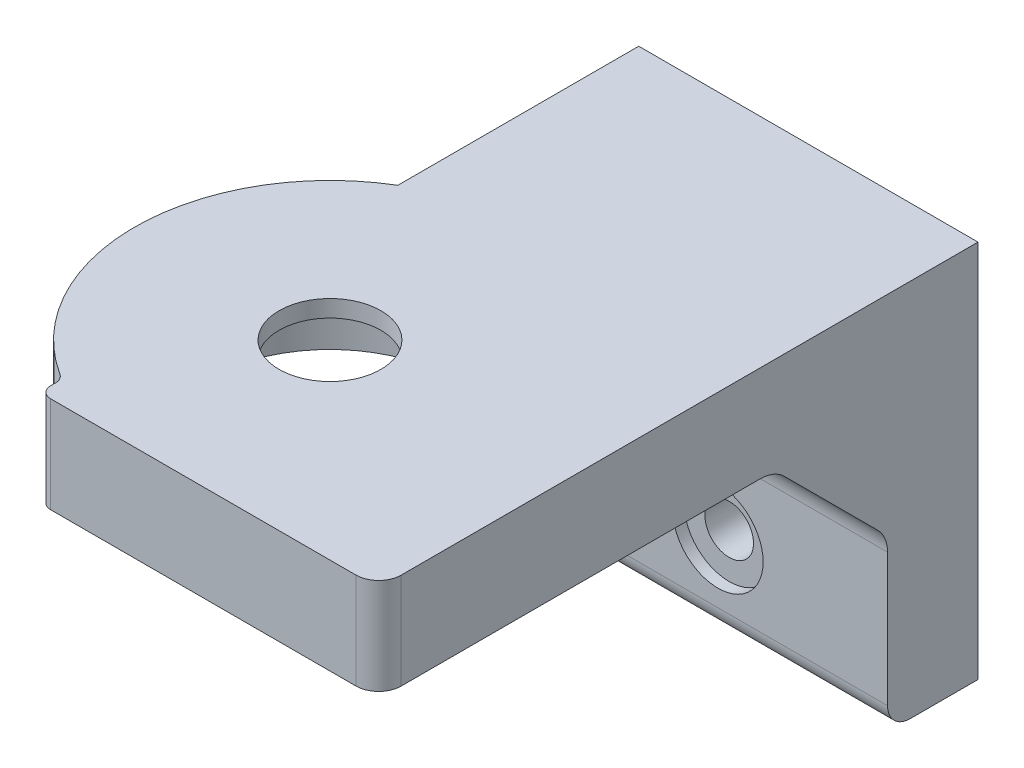
ISO-10303-21;
HEADER;
FILE_DESCRIPTION(('STEP AP214'),'2;1');
FILE_NAME('part.step','',(''),(''),'','','');
FILE_SCHEMA(('AUTOMOTIVE_DESIGN { 1 0 10303 214 1 1 1 1 }'));
ENDSEC;
DATA;
#1=APPLICATION_CONTEXT('core data for automotive mechanical design processes');
#2=APPLICATION_PROTOCOL_DEFINITION('international standard','automotive_design',2000,#1);
#3=PRODUCT_CONTEXT('',#1,'mechanical');
#4=PRODUCT('Part','Part','',(#3));
#5=PRODUCT_RELATED_PRODUCT_CATEGORY('part','',(#4));
#6=PRODUCT_DEFINITION_FORMATION('','',#4);
#7=PRODUCT_DEFINITION_CONTEXT('part definition',#1,'design');
#8=PRODUCT_DEFINITION('design','',#6,#7);
#9=PRODUCT_DEFINITION_SHAPE('','',#8);
#10=(LENGTH_UNIT() NAMED_UNIT(*) SI_UNIT(.MILLI.,.METRE.));
#11=(NAMED_UNIT(*) PLANE_ANGLE_UNIT() SI_UNIT($,.RADIAN.));
#12=(NAMED_UNIT(*) SI_UNIT($,.STERADIAN.) SOLID_ANGLE_UNIT());
#13=UNCERTAINTY_MEASURE_WITH_UNIT(LENGTH_MEASURE(1.E-05),#10,'distance_accuracy_value','');
#14=(GEOMETRIC_REPRESENTATION_CONTEXT(3) GLOBAL_UNCERTAINTY_ASSIGNED_CONTEXT((#13)) GLOBAL_UNIT_ASSIGNED_CONTEXT((#10,
#11,#12)) REPRESENTATION_CONTEXT('',''));
#15=CARTESIAN_POINT('',(0.,0.,0.));
#16=DIRECTION('',(0.,0.,1.));
#17=DIRECTION('',(1.,0.,0.));
#18=AXIS2_PLACEMENT_3D('',#15,#16,#17);
#19=CARTESIAN_POINT('',(-25.3000004357424,-651.000000000001,1.38777878078145E-13));
#20=DIRECTION('',(0.,0.,1.));
#21=DIRECTION('',(1.,0.,0.));
#22=AXIS2_PLACEMENT_3D('',#19,#20,#21);
#23=CYLINDRICAL_SURFACE('',#22,2.15);
#24=CARTESIAN_POINT('',(-25.3000004357424,-651.000000000001,1.38777878078145E-13));
#25=DIRECTION('',(0.,0.,1.));
#26=DIRECTION('',(1.,0.,0.));
#27=AXIS2_PLACEMENT_3D('',#24,#25,#26);
#28=CIRCLE('',#27,2.15);
#29=CARTESIAN_POINT('',(-23.1500004357424,-651.000000000001,1.38777878078145E-13));
#30=VERTEX_POINT('',#29);
#31=EDGE_CURVE('E187',#30,#30,#28,.T.);
#32=ORIENTED_EDGE('',*,*,#31,.F.);
#33=EDGE_LOOP('',(#32));
#34=FACE_BOUND('',#33,.T.);
#35=CARTESIAN_POINT('',(-25.3000004357446,-651.000000000001,6.99999999999998));
#36=DIRECTION('',(0.,0.,1.));
#37=DIRECTION('',(1.,0.,0.));
#38=AXIS2_PLACEMENT_3D('',#35,#36,#37);
#39=CIRCLE('',#38,2.15);
#40=CARTESIAN_POINT('',(-23.1500004357446,-651.000000000001,6.99999999999998));
#41=VERTEX_POINT('',#40);
#42=EDGE_CURVE('E478',#41,#41,#39,.T.);
#43=ORIENTED_EDGE('',*,*,#42,.T.);
#44=EDGE_LOOP('',(#43));
#45=FACE_BOUND('',#44,.T.);
#46=ADVANCED_FACE('F55',(#34,#45),#23,.F.);
#47=CARTESIAN_POINT('',(2.66977248110864E-12,-626.500000000001,0.));
#48=DIRECTION('',(0.,1.,0.));
#49=DIRECTION('',(-1.,0.,0.));
#50=AXIS2_PLACEMENT_3D('',#47,#48,#49);
#51=PLANE('',#50);
#52=CARTESIAN_POINT('',(-31.4500004358079,-626.500000000001,36.149999999999));
#53=DIRECTION('',(0.,1.,0.));
#54=DIRECTION('',(-1.,0.,0.));
#55=AXIS2_PLACEMENT_3D('',#52,#53,#54);
#56=CIRCLE('',#55,4.5);
#57=CARTESIAN_POINT('',(-35.9500004358079,-626.500000000001,36.149999999999));
#58=VERTEX_POINT('',#57);
#59=EDGE_CURVE('E182',#58,#58,#56,.T.);
#60=ORIENTED_EDGE('',*,*,#59,.T.);
#61=EDGE_LOOP('',(#60));
#62=FACE_BOUND('',#61,.T.);
#63=CARTESIAN_POINT('',(-31.4500004358096,-626.500000000001,36.1500000000001));
#64=DIRECTION('',(0.,1.,0.));
#65=DIRECTION('',(-1.,0.,0.));
#66=AXIS2_PLACEMENT_3D('',#63,#64,#65);
#67=CIRCLE('',#66,11.);
#68=CARTESIAN_POINT('',(-42.4500004358096,-626.500000000001,36.1500000000001));
#69=VERTEX_POINT('',#68);
#70=EDGE_CURVE('E232',#69,#69,#67,.T.);
#71=ORIENTED_EDGE('',*,*,#70,.F.);
#72=EDGE_LOOP('',(#71));
#73=FACE_BOUND('',#72,.T.);
#74=ADVANCED_FACE('F356',(#62,#73),#51,.F.);
#75=CARTESIAN_POINT('',(-31.4500004358091,-626.500000000001,36.149999999999));
#76=DIRECTION('',(0.,1.,0.));
#77=DIRECTION('',(-1.,0.,0.));
#78=AXIS2_PLACEMENT_3D('',#75,#76,#77);
#79=CYLINDRICAL_SURFACE('',#78,17.2871339440318);
#80=CARTESIAN_POINT('',(-31.4500004358091,-633.500000000001,36.149999999999));
#81=DIRECTION('',(0.,1.,0.));
#82=DIRECTION('',(-1.,0.,0.));
#83=AXIS2_PLACEMENT_3D('',#80,#81,#82);
#84=CIRCLE('',#83,17.2871339440318);
#85=CARTESIAN_POINT('',(-40.300000435745,-633.500000000001,21.2999999999979));
#86=VERTEX_POINT('',#85);
#87=CARTESIAN_POINT('',(-40.7613703786741,-633.500000000001,50.715142971697));
#88=VERTEX_POINT('',#87);
#89=EDGE_CURVE('E199',#86,#88,#84,.T.);
#90=ORIENTED_EDGE('',*,*,#89,.T.);
#91=DIRECTION('',(0.,1.,0.));
#92=VECTOR('',#91,1.);
#93=CARTESIAN_POINT('',(-40.7613703786741,-626.500000000001,50.715142971697));
#94=LINE('',#93,#92);
#95=CARTESIAN_POINT('',(-40.7613703786741,-625.000000000001,50.715142971697));
#96=VERTEX_POINT('',#95);
#97=EDGE_CURVE('E242',#88,#96,#94,.T.);
#98=ORIENTED_EDGE('',*,*,#97,.T.);
#99=CARTESIAN_POINT('',(-31.4500004358091,-625.000000000001,36.149999999999));
#100=DIRECTION('',(0.,1.,0.));
#101=DIRECTION('',(-1.,0.,0.));
#102=AXIS2_PLACEMENT_3D('',#99,#100,#101);
#103=CIRCLE('',#102,17.2871339440318);
#104=CARTESIAN_POINT('',(-40.3000004357449,-625.000000000001,21.2999999999979));
#105=VERTEX_POINT('',#104);
#106=EDGE_CURVE('E211',#96,#105,#103,.F.);
#107=ORIENTED_EDGE('',*,*,#106,.T.);
#108=DIRECTION('',(0.,1.,0.));
#109=VECTOR('',#108,1.);
#110=CARTESIAN_POINT('',(-40.3000004357449,-626.500000000001,21.2999999999979));
#111=LINE('',#110,#109);
#112=EDGE_CURVE('E229',#86,#105,#111,.T.);
#113=ORIENTED_EDGE('',*,*,#112,.F.);
#114=EDGE_LOOP('',(#90,#98,#107,#113));
#115=FACE_BOUND('',#114,.T.);
#116=ADVANCED_FACE('F329',(#115),#79,.T.);
#117=CARTESIAN_POINT('',(-40.300000435745,-626.500000000001,0.));
#118=DIRECTION('',(-1.,0.,0.));
#119=DIRECTION('',(0.,-1.,0.));
#120=AXIS2_PLACEMENT_3D('',#117,#118,#119);
#121=PLANE('',#120);
#122=DIRECTION('',(0.,0.,-1.));
#123=VECTOR('',#122,1.);
#124=CARTESIAN_POINT('',(-40.3000004357448,-658.500000000001,8.00000000000059));
#125=LINE('',#124,#123);
#126=CARTESIAN_POINT('',(-40.3000004357449,-658.500000000001,6.00000000000059));
#127=VERTEX_POINT('',#126);
#128=CARTESIAN_POINT('',(-40.300000435745,-658.500000000001,5.87238597438503E-13));
#129=VERTEX_POINT('',#128);
#130=EDGE_CURVE('E172',#127,#129,#125,.T.);
#131=ORIENTED_EDGE('',*,*,#130,.F.);
#132=CARTESIAN_POINT('',(-40.3000004357449,-656.500000000001,6.00000000000059));
#133=DIRECTION('',(-1.,0.,0.));
#134=DIRECTION('',(0.,-1.,0.));
#135=AXIS2_PLACEMENT_3D('',#132,#133,#134);
#136=CIRCLE('',#135,2.);
#137=CARTESIAN_POINT('',(-40.3000004357448,-656.500000000001,8.00000000000059));
#138=VERTEX_POINT('',#137);
#139=EDGE_CURVE('E77',#127,#138,#136,.T.);
#140=ORIENTED_EDGE('',*,*,#139,.T.);
#141=DIRECTION('',(0.,1.,0.));
#142=VECTOR('',#141,1.);
#143=CARTESIAN_POINT('',(-40.3000004357448,-633.500000000001,8.00000000000059));
#144=LINE('',#143,#142);
#145=CARTESIAN_POINT('',(-40.3000004357448,-644.74264068712,8.00000000000059));
#146=VERTEX_POINT('',#145);
#147=EDGE_CURVE('E186',#138,#146,#144,.T.);
#148=ORIENTED_EDGE('',*,*,#147,.T.);
#149=CARTESIAN_POINT('',(-40.3000004357449,-644.74264068712,11.0000000000006));
#150=DIRECTION('',(-1.,0.,0.));
#151=DIRECTION('',(0.,-1.,0.));
#152=AXIS2_PLACEMENT_3D('',#149,#150,#151);
#153=CIRCLE('',#152,3.);
#154=CARTESIAN_POINT('',(-40.3000004357449,-642.621320343561,8.87867965644104));
#155=VERTEX_POINT('',#154);
#156=EDGE_CURVE('E282',#146,#155,#153,.F.);
#157=ORIENTED_EDGE('',*,*,#156,.T.);
#158=DIRECTION('',(0.,0.707106781186545,0.70710678118655));
#159=VECTOR('',#158,1.);
#160=CARTESIAN_POINT('',(-40.300000435745,-633.500000000001,18.0000000000006));
#161=LINE('',#160,#159);
#162=CARTESIAN_POINT('',(-40.300000435745,-634.378679656442,17.1213203435603));
#163=VERTEX_POINT('',#162);
#164=EDGE_CURVE('E239',#155,#163,#161,.T.);
#165=ORIENTED_EDGE('',*,*,#164,.T.);
#166=CARTESIAN_POINT('',(-40.300000435745,-636.500000000001,19.2426406871199));
#167=DIRECTION('',(-1.,0.,0.));
#168=DIRECTION('',(0.,-1.,0.));
#169=AXIS2_PLACEMENT_3D('',#166,#167,#168);
#170=CIRCLE('',#169,3.);
#171=CARTESIAN_POINT('',(-40.300000435745,-633.500000000001,19.2426406871199));
#172=VERTEX_POINT('',#171);
#173=EDGE_CURVE('E288',#163,#172,#170,.F.);
#174=ORIENTED_EDGE('',*,*,#173,.T.);
#175=DIRECTION('',(0.,0.,1.));
#176=VECTOR('',#175,1.);
#177=CARTESIAN_POINT('',(-40.300000435745,-633.500000000001,0.));
#178=LINE('',#177,#176);
#179=EDGE_CURVE('E209',#172,#86,#178,.T.);
#180=ORIENTED_EDGE('',*,*,#179,.T.);
#181=ORIENTED_EDGE('',*,*,#112,.T.);
#182=DIRECTION('',(0.,0.,1.));
#183=VECTOR('',#182,1.);
#184=CARTESIAN_POINT('',(-40.300000435745,-625.000000000001,0.));
#185=LINE('',#184,#183);
#186=CARTESIAN_POINT('',(-40.300000435745,-625.000000000001,5.82867087928207E-13));
#187=VERTEX_POINT('',#186);
#188=EDGE_CURVE('E224',#187,#105,#185,.T.);
#189=ORIENTED_EDGE('',*,*,#188,.F.);
#190=DIRECTION('',(0.,1.,0.));
#191=VECTOR('',#190,1.);
#192=CARTESIAN_POINT('',(-40.300000435745,-626.500000000001,5.82867087928207E-13));
#193=LINE('',#192,#191);
#194=EDGE_CURVE('E181',#129,#187,#193,.T.);
#195=ORIENTED_EDGE('',*,*,#194,.F.);
#196=EDGE_LOOP('',(#131,#140,#148,#157,#165,#174,#180,#181,#189,#195));
#197=FACE_BOUND('',#196,.T.);
#198=ADVANCED_FACE('F293',(#197),#121,.T.);
#199=CARTESIAN_POINT('',(2.66977248110864E-12,-626.500000000001,0.));
#200=DIRECTION('',(0.,0.,1.));
#201=DIRECTION('',(1.,0.,0.));
#202=AXIS2_PLACEMENT_3D('',#199,#200,#201);
#203=PLANE('',#202);
#204=ORIENTED_EDGE('',*,*,#31,.T.);
#205=EDGE_LOOP('',(#204));
#206=FACE_BOUND('',#205,.T.);
#207=DIRECTION('',(1.,0.,0.));
#208=VECTOR('',#207,1.);
#209=CARTESIAN_POINT('',(2.66453525910038E-12,-625.000000000001,0.));
#210=LINE('',#209,#208);
#211=CARTESIAN_POINT('',(-10.3000004358096,-625.000000000001,1.38777878078145E-13));
#212=VERTEX_POINT('',#211);
#213=EDGE_CURVE('E180',#187,#212,#210,.T.);
#214=ORIENTED_EDGE('',*,*,#213,.T.);
#215=DIRECTION('',(0.,1.,0.));
#216=VECTOR('',#215,1.);
#217=CARTESIAN_POINT('',(-10.3000004358096,-626.500000000001,1.38777878078145E-13));
#218=LINE('',#217,#216);
#219=CARTESIAN_POINT('',(-10.3000004358096,-658.500000000001,1.50088281492348E-13));
#220=VERTEX_POINT('',#219);
#221=EDGE_CURVE('E165',#220,#212,#218,.T.);
#222=ORIENTED_EDGE('',*,*,#221,.F.);
#223=DIRECTION('',(-1.,0.,0.));
#224=VECTOR('',#223,1.);
#225=CARTESIAN_POINT('',(-40.300000435745,-658.500000000001,5.87238597438503E-13));
#226=LINE('',#225,#224);
#227=EDGE_CURVE('E178',#220,#129,#226,.T.);
#228=ORIENTED_EDGE('',*,*,#227,.T.);
#229=ORIENTED_EDGE('',*,*,#194,.T.);
#230=EDGE_LOOP('',(#214,#222,#228,#229));
#231=FACE_BOUND('',#230,.T.);
#232=ADVANCED_FACE('F177',(#206,#231),#203,.F.);
#233=CARTESIAN_POINT('',(-10.3000004358096,-626.500000000001,0.));
#234=DIRECTION('',(-1.,0.,0.));
#235=DIRECTION('',(0.,-1.,0.));
#236=AXIS2_PLACEMENT_3D('',#233,#234,#235);
#237=PLANE('',#236);
#238=DIRECTION('',(0.,-1.,0.));
#239=VECTOR('',#238,1.);
#240=CARTESIAN_POINT('',(-10.3000004358095,-633.500000000001,8.00000000000015));
#241=LINE('',#240,#239);
#242=CARTESIAN_POINT('',(-10.3000004358095,-644.74264068712,8.00000000000015));
#243=VERTEX_POINT('',#242);
#244=CARTESIAN_POINT('',(-10.3000004358095,-656.500000000001,8.00000000000015));
#245=VERTEX_POINT('',#244);
#246=EDGE_CURVE('E173',#243,#245,#241,.T.);
#247=ORIENTED_EDGE('',*,*,#246,.T.);
#248=CARTESIAN_POINT('',(-10.3000004358095,-656.500000000001,6.00000000000015));
#249=DIRECTION('',(-1.,0.,0.));
#250=DIRECTION('',(0.,-1.,0.));
#251=AXIS2_PLACEMENT_3D('',#248,#249,#250);
#252=CIRCLE('',#251,2.);
#253=CARTESIAN_POINT('',(-10.3000004358095,-658.500000000001,6.00000000000015));
#254=VERTEX_POINT('',#253);
#255=EDGE_CURVE('E12',#245,#254,#252,.F.);
#256=ORIENTED_EDGE('',*,*,#255,.T.);
#257=DIRECTION('',(0.,0.,-1.));
#258=VECTOR('',#257,1.);
#259=CARTESIAN_POINT('',(-10.3000004358095,-658.500000000001,8.00000000000015));
#260=LINE('',#259,#258);
#261=EDGE_CURVE('E161',#254,#220,#260,.T.);
#262=ORIENTED_EDGE('',*,*,#261,.T.);
#263=ORIENTED_EDGE('',*,*,#221,.T.);
#264=DIRECTION('',(0.,0.,1.));
#265=VECTOR('',#264,1.);
#266=CARTESIAN_POINT('',(-10.3000004358096,-625.000000000001,0.));
#267=LINE('',#266,#265);
#268=CARTESIAN_POINT('',(-10.3000004358096,-625.000000000001,51.));
#269=VERTEX_POINT('',#268);
#270=EDGE_CURVE('E221',#212,#269,#267,.T.);
#271=ORIENTED_EDGE('',*,*,#270,.T.);
#272=DIRECTION('',(0.,1.,0.));
#273=VECTOR('',#272,1.);
#274=CARTESIAN_POINT('',(-10.3000004358096,-626.500000000001,51.));
#275=LINE('',#274,#273);
#276=CARTESIAN_POINT('',(-10.3000004358096,-633.500000000001,51.));
#277=VERTEX_POINT('',#276);
#278=EDGE_CURVE('E267',#269,#277,#275,.F.);
#279=ORIENTED_EDGE('',*,*,#278,.T.);
#280=DIRECTION('',(0.,0.,1.));
#281=VECTOR('',#280,1.);
#282=CARTESIAN_POINT('',(-10.3000004358096,-633.500000000001,0.));
#283=LINE('',#282,#281);
#284=CARTESIAN_POINT('',(-10.3000004358096,-633.500000000001,19.2426406871195));
#285=VERTEX_POINT('',#284);
#286=EDGE_CURVE('E207',#285,#277,#283,.T.);
#287=ORIENTED_EDGE('',*,*,#286,.F.);
#288=CARTESIAN_POINT('',(-10.3000004358096,-636.500000000001,19.2426406871195));
#289=DIRECTION('',(-1.,0.,0.));
#290=DIRECTION('',(0.,-1.,0.));
#291=AXIS2_PLACEMENT_3D('',#288,#289,#290);
#292=CIRCLE('',#291,3.);
#293=CARTESIAN_POINT('',(-10.3000004358096,-634.378679656441,17.1213203435599));
#294=VERTEX_POINT('',#293);
#295=EDGE_CURVE('E286',#285,#294,#292,.T.);
#296=ORIENTED_EDGE('',*,*,#295,.T.);
#297=DIRECTION('',(0.,-0.707106781186545,-0.70710678118655));
#298=VECTOR('',#297,1.);
#299=CARTESIAN_POINT('',(-10.3000004358096,-639.000000000001,12.5000000000001));
#300=LINE('',#299,#298);
#301=CARTESIAN_POINT('',(-10.3000004358096,-642.621320343561,8.8786796564406));
#302=VERTEX_POINT('',#301);
#303=EDGE_CURVE('E236',#294,#302,#300,.T.);
#304=ORIENTED_EDGE('',*,*,#303,.T.);
#305=CARTESIAN_POINT('',(-10.3000004358096,-644.74264068712,11.0000000000002));
#306=DIRECTION('',(-1.,0.,0.));
#307=DIRECTION('',(0.,-1.,0.));
#308=AXIS2_PLACEMENT_3D('',#305,#306,#307);
#309=CIRCLE('',#308,3.);
#310=EDGE_CURVE('E284',#302,#243,#309,.T.);
#311=ORIENTED_EDGE('',*,*,#310,.T.);
#312=EDGE_LOOP('',(#247,#256,#262,#263,#271,#279,#287,#296,#304,#311));
#313=FACE_BOUND('',#312,.T.);
#314=ADVANCED_FACE('F163',(#313),#237,.F.);
#315=CARTESIAN_POINT('',(2.7252836323399E-12,-626.500000000001,53.));
#316=DIRECTION('',(0.,0.,-1.));
#317=DIRECTION('',(-1.,0.,0.));
#318=AXIS2_PLACEMENT_3D('',#315,#316,#317);
#319=PLANE('',#318);
#320=DIRECTION('',(-1.,0.,0.));
#321=VECTOR('',#320,1.);
#322=CARTESIAN_POINT('',(2.71873027560773E-12,-633.500000000001,53.));
#323=LINE('',#322,#321);
#324=CARTESIAN_POINT('',(-12.3000004358096,-633.500000000001,53.));
#325=VERTEX_POINT('',#324);
#326=CARTESIAN_POINT('',(-39.3000004357449,-633.500000000001,53.));
#327=VERTEX_POINT('',#326);
#328=EDGE_CURVE('E205',#325,#327,#323,.T.);
#329=ORIENTED_EDGE('',*,*,#328,.F.);
#330=DIRECTION('',(0.,1.,0.));
#331=VECTOR('',#330,1.);
#332=CARTESIAN_POINT('',(-12.3000004358096,-626.500000000001,53.));
#333=LINE('',#332,#331);
#334=CARTESIAN_POINT('',(-12.3000004358096,-625.000000000001,53.));
#335=VERTEX_POINT('',#334);
#336=EDGE_CURVE('E262',#325,#335,#333,.T.);
#337=ORIENTED_EDGE('',*,*,#336,.T.);
#338=DIRECTION('',(-1.,0.,0.));
#339=VECTOR('',#338,1.);
#340=CARTESIAN_POINT('',(2.72004641033163E-12,-625.000000000001,53.));
#341=LINE('',#340,#339);
#342=CARTESIAN_POINT('',(-39.3000004357449,-625.000000000001,53.));
#343=VERTEX_POINT('',#342);
#344=EDGE_CURVE('E219',#335,#343,#341,.T.);
#345=ORIENTED_EDGE('',*,*,#344,.T.);
#346=DIRECTION('',(0.,1.,0.));
#347=VECTOR('',#346,1.);
#348=CARTESIAN_POINT('',(-39.3000004357449,-626.500000000001,53.));
#349=LINE('',#348,#347);
#350=EDGE_CURVE('E253',#343,#327,#349,.F.);
#351=ORIENTED_EDGE('',*,*,#350,.T.);
#352=EDGE_LOOP('',(#329,#337,#345,#351));
#353=FACE_BOUND('',#352,.T.);
#354=ADVANCED_FACE('F311',(#353),#319,.F.);
#355=CARTESIAN_POINT('',(-40.3000004357449,-626.500000000001,0.));
#356=DIRECTION('',(1.,0.,0.));
#357=DIRECTION('',(0.,1.,0.));
#358=AXIS2_PLACEMENT_3D('',#355,#356,#357);
#359=PLANE('',#358);
#360=DIRECTION('',(0.,0.,-1.));
#361=VECTOR('',#360,1.);
#362=CARTESIAN_POINT('',(-40.3000004357449,-625.000000000001,0.));
#363=LINE('',#362,#361);
#364=CARTESIAN_POINT('',(-40.3000004357449,-625.000000000001,52.));
#365=VERTEX_POINT('',#364);
#366=CARTESIAN_POINT('',(-40.3000004357449,-625.000000000001,51.5576853514144));
#367=VERTEX_POINT('',#366);
#368=EDGE_CURVE('E216',#365,#367,#363,.T.);
#369=ORIENTED_EDGE('',*,*,#368,.T.);
#370=DIRECTION('',(0.,-1.,0.));
#371=VECTOR('',#370,1.);
#372=CARTESIAN_POINT('',(-40.3000004357449,-633.500000000001,51.5576853514144));
#373=LINE('',#372,#371);
#374=CARTESIAN_POINT('',(-40.3000004357449,-633.500000000001,51.5576853514144));
#375=VERTEX_POINT('',#374);
#376=EDGE_CURVE('E248',#367,#375,#373,.T.);
#377=ORIENTED_EDGE('',*,*,#376,.T.);
#378=DIRECTION('',(0.,0.,-1.));
#379=VECTOR('',#378,1.);
#380=CARTESIAN_POINT('',(-40.3000004357449,-633.500000000001,0.));
#381=LINE('',#380,#379);
#382=CARTESIAN_POINT('',(-40.3000004357449,-633.500000000001,52.));
#383=VERTEX_POINT('',#382);
#384=EDGE_CURVE('E202',#383,#375,#381,.T.);
#385=ORIENTED_EDGE('',*,*,#384,.F.);
#386=DIRECTION('',(0.,1.,0.));
#387=VECTOR('',#386,1.);
#388=CARTESIAN_POINT('',(-40.3000004357449,-626.500000000001,52.));
#389=LINE('',#388,#387);
#390=EDGE_CURVE('E245',#383,#365,#389,.T.);
#391=ORIENTED_EDGE('',*,*,#390,.T.);
#392=EDGE_LOOP('',(#369,#377,#385,#391));
#393=FACE_BOUND('',#392,.T.);
#394=ADVANCED_FACE('F320',(#393),#359,.F.);
#395=CARTESIAN_POINT('',(-31.4500004358079,-626.500000000001,36.149999999999));
#396=DIRECTION('',(0.,1.,0.));
#397=DIRECTION('',(-1.,0.,0.));
#398=AXIS2_PLACEMENT_3D('',#395,#396,#397);
#399=CYLINDRICAL_SURFACE('',#398,4.5);
#400=ORIENTED_EDGE('',*,*,#59,.F.);
#401=EDGE_LOOP('',(#400));
#402=FACE_BOUND('',#401,.T.);
#403=CARTESIAN_POINT('',(-31.4500004358079,-625.000000000001,36.149999999999));
#404=DIRECTION('',(0.,1.,0.));
#405=DIRECTION('',(-1.,0.,0.));
#406=AXIS2_PLACEMENT_3D('',#403,#404,#405);
#407=CIRCLE('',#406,4.5);
#408=CARTESIAN_POINT('',(-35.9500004358079,-625.000000000001,36.149999999999));
#409=VERTEX_POINT('',#408);
#410=EDGE_CURVE('E214',#409,#409,#407,.T.);
#411=ORIENTED_EDGE('',*,*,#410,.T.);
#412=EDGE_LOOP('',(#411));
#413=FACE_BOUND('',#412,.T.);
#414=ADVANCED_FACE('F382',(#402,#413),#399,.F.);
#415=CARTESIAN_POINT('',(2.66453525910038E-12,-625.000000000001,0.));
#416=DIRECTION('',(0.,1.,0.));
#417=DIRECTION('',(-1.,0.,0.));
#418=AXIS2_PLACEMENT_3D('',#415,#416,#417);
#419=PLANE('',#418);
#420=ORIENTED_EDGE('',*,*,#344,.F.);
#421=CARTESIAN_POINT('',(-12.3000004358096,-625.000000000001,51.));
#422=DIRECTION('',(0.,1.,0.));
#423=DIRECTION('',(-1.,0.,0.));
#424=AXIS2_PLACEMENT_3D('',#421,#422,#423);
#425=CIRCLE('',#424,2.);
#426=EDGE_CURVE('E265',#335,#269,#425,.T.);
#427=ORIENTED_EDGE('',*,*,#426,.T.);
#428=ORIENTED_EDGE('',*,*,#270,.F.);
#429=ORIENTED_EDGE('',*,*,#213,.F.);
#430=ORIENTED_EDGE('',*,*,#188,.T.);
#431=ORIENTED_EDGE('',*,*,#106,.F.);
#432=CARTESIAN_POINT('',(-41.3000004357449,-625.000000000001,51.5576853514144));
#433=DIRECTION('',(0.,1.,0.));
#434=DIRECTION('',(-1.,0.,0.));
#435=AXIS2_PLACEMENT_3D('',#432,#433,#434);
#436=CIRCLE('',#435,1.);
#437=EDGE_CURVE('E258',#96,#367,#436,.F.);
#438=ORIENTED_EDGE('',*,*,#437,.T.);
#439=ORIENTED_EDGE('',*,*,#368,.F.);
#440=CARTESIAN_POINT('',(-39.3000004357449,-625.000000000001,52.));
#441=DIRECTION('',(0.,1.,0.));
#442=DIRECTION('',(-1.,0.,0.));
#443=AXIS2_PLACEMENT_3D('',#440,#441,#442);
#444=CIRCLE('',#443,1.);
#445=EDGE_CURVE('E250',#365,#343,#444,.T.);
#446=ORIENTED_EDGE('',*,*,#445,.T.);
#447=EDGE_LOOP('',(#420,#427,#428,#429,#430,#431,#438,#439,#446));
#448=FACE_BOUND('',#447,.T.);
#449=ORIENTED_EDGE('',*,*,#410,.F.);
#450=EDGE_LOOP('',(#449));
#451=FACE_BOUND('',#450,.T.);
#452=ADVANCED_FACE('F297',(#448,#451),#419,.T.);
#453=CARTESIAN_POINT('',(-31.4500004358091,-633.500000000001,36.149999999999));
#454=DIRECTION('',(0.,1.,0.));
#455=DIRECTION('',(-1.,0.,0.));
#456=AXIS2_PLACEMENT_3D('',#453,#454,#455);
#457=PLANE('',#456);
#458=CARTESIAN_POINT('',(-31.4500004358096,-633.500000000001,36.1500000000001));
#459=DIRECTION('',(0.,1.,0.));
#460=DIRECTION('',(-1.,0.,0.));
#461=AXIS2_PLACEMENT_3D('',#458,#459,#460);
#462=CIRCLE('',#461,11.);
#463=CARTESIAN_POINT('',(-42.4500004358096,-633.500000000001,36.1500000000001));
#464=VERTEX_POINT('',#463);
#465=EDGE_CURVE('E195',#464,#464,#462,.T.);
#466=ORIENTED_EDGE('',*,*,#465,.T.);
#467=EDGE_LOOP('',(#466));
#468=FACE_BOUND('',#467,.T.);
#469=ORIENTED_EDGE('',*,*,#179,.F.);
#470=DIRECTION('',(1.,0.,0.));
#471=VECTOR('',#470,1.);
#472=CARTESIAN_POINT('',(-10.3000004358096,-633.500000000001,19.2426406871195));
#473=LINE('',#472,#471);
#474=EDGE_CURVE('E279',#172,#285,#473,.T.);
#475=ORIENTED_EDGE('',*,*,#474,.T.);
#476=ORIENTED_EDGE('',*,*,#286,.T.);
#477=CARTESIAN_POINT('',(-12.3000004358096,-633.500000000001,51.));
#478=DIRECTION('',(0.,1.,0.));
#479=DIRECTION('',(-1.,0.,0.));
#480=AXIS2_PLACEMENT_3D('',#477,#478,#479);
#481=CIRCLE('',#480,2.);
#482=EDGE_CURVE('E270',#277,#325,#481,.F.);
#483=ORIENTED_EDGE('',*,*,#482,.T.);
#484=ORIENTED_EDGE('',*,*,#328,.T.);
#485=CARTESIAN_POINT('',(-39.3000004357449,-633.500000000001,52.));
#486=DIRECTION('',(0.,1.,0.));
#487=DIRECTION('',(-1.,0.,0.));
#488=AXIS2_PLACEMENT_3D('',#485,#486,#487);
#489=CIRCLE('',#488,1.);
#490=EDGE_CURVE('E256',#327,#383,#489,.F.);
#491=ORIENTED_EDGE('',*,*,#490,.T.);
#492=ORIENTED_EDGE('',*,*,#384,.T.);
#493=CARTESIAN_POINT('',(-41.3000004357449,-633.500000000001,51.5576853514144));
#494=DIRECTION('',(0.,1.,0.));
#495=DIRECTION('',(-1.,0.,0.));
#496=AXIS2_PLACEMENT_3D('',#493,#494,#495);
#497=CIRCLE('',#496,1.);
#498=EDGE_CURVE('E260',#375,#88,#497,.T.);
#499=ORIENTED_EDGE('',*,*,#498,.T.);
#500=ORIENTED_EDGE('',*,*,#89,.F.);
#501=EDGE_LOOP('',(#469,#475,#476,#483,#484,#491,#492,#499,#500));
#502=FACE_BOUND('',#501,.T.);
#503=ADVANCED_FACE('F309',(#468,#502),#457,.F.);
#504=CARTESIAN_POINT('',(-31.4500004358096,-633.500000000001,36.1500000000001));
#505=DIRECTION('',(0.,1.,0.));
#506=DIRECTION('',(-1.,0.,0.));
#507=AXIS2_PLACEMENT_3D('',#504,#505,#506);
#508=CYLINDRICAL_SURFACE('',#507,11.);
#509=ORIENTED_EDGE('',*,*,#465,.F.);
#510=EDGE_LOOP('',(#509));
#511=FACE_BOUND('',#510,.T.);
#512=ORIENTED_EDGE('',*,*,#70,.T.);
#513=EDGE_LOOP('',(#512));
#514=FACE_BOUND('',#513,.T.);
#515=ADVANCED_FACE('F373',(#511,#514),#508,.F.);
#516=CARTESIAN_POINT('',(-40.3000004357448,-658.500000000001,8.00000000000059));
#517=DIRECTION('',(0.,-1.,0.));
#518=DIRECTION('',(0.,0.,-1.));
#519=AXIS2_PLACEMENT_3D('',#516,#517,#518);
#520=PLANE('',#519);
#521=ORIENTED_EDGE('',*,*,#261,.F.);
#522=DIRECTION('',(-1.,0.,0.));
#523=VECTOR('',#522,1.);
#524=CARTESIAN_POINT('',(-40.3000004357449,-658.500000000001,6.00000000000059));
#525=LINE('',#524,#523);
#526=EDGE_CURVE('E290',#254,#127,#525,.T.);
#527=ORIENTED_EDGE('',*,*,#526,.T.);
#528=ORIENTED_EDGE('',*,*,#130,.T.);
#529=ORIENTED_EDGE('',*,*,#227,.F.);
#530=EDGE_LOOP('',(#521,#527,#528,#529));
#531=FACE_BOUND('',#530,.T.);
#532=ADVANCED_FACE('F184',(#531),#520,.T.);
#533=CARTESIAN_POINT('',(1.16573417585893E-13,0.,8.));
#534=DIRECTION('',(0.,0.,1.));
#535=DIRECTION('',(1.,0.,0.));
#536=AXIS2_PLACEMENT_3D('',#533,#534,#535);
#537=PLANE('',#536);
#538=CARTESIAN_POINT('',(-25.3000004357446,-651.000000000001,7.99999999999998));
#539=DIRECTION('',(0.,0.,1.));
#540=DIRECTION('',(1.,0.,0.));
#541=AXIS2_PLACEMENT_3D('',#538,#539,#540);
#542=CIRCLE('',#541,4.);
#543=CARTESIAN_POINT('',(-21.3000004357446,-651.000000000001,7.99999999999998));
#544=VERTEX_POINT('',#543);
#545=EDGE_CURVE('E482',#544,#544,#542,.T.);
#546=ORIENTED_EDGE('',*,*,#545,.F.);
#547=EDGE_LOOP('',(#546));
#548=FACE_BOUND('',#547,.T.);
#549=ORIENTED_EDGE('',*,*,#147,.F.);
#550=DIRECTION('',(-1.,0.,0.));
#551=VECTOR('',#550,1.);
#552=CARTESIAN_POINT('',(1.16573417585893E-13,-656.500000000001,8.));
#553=LINE('',#552,#551);
#554=EDGE_CURVE('E63',#138,#245,#553,.F.);
#555=ORIENTED_EDGE('',*,*,#554,.T.);
#556=ORIENTED_EDGE('',*,*,#246,.F.);
#557=DIRECTION('',(-1.,0.,0.));
#558=VECTOR('',#557,1.);
#559=CARTESIAN_POINT('',(2.84027883355182E-12,-644.74264068712,8.));
#560=LINE('',#559,#558);
#561=EDGE_CURVE('E272',#243,#146,#560,.T.);
#562=ORIENTED_EDGE('',*,*,#561,.T.);
#563=EDGE_LOOP('',(#549,#555,#556,#562));
#564=FACE_BOUND('',#563,.T.);
#565=ADVANCED_FACE('F345',(#548,#564),#537,.T.);
#566=CARTESIAN_POINT('',(-31.4500004358093,-633.500000000001,18.0000000000006));
#567=DIRECTION('',(0.,0.70710678118655,-0.707106781186545));
#568=DIRECTION('',(1.,0.,0.));
#569=AXIS2_PLACEMENT_3D('',#566,#567,#568);
#570=PLANE('',#569);
#571=ORIENTED_EDGE('',*,*,#164,.F.);
#572=DIRECTION('',(-1.,0.,0.));
#573=VECTOR('',#572,1.);
#574=CARTESIAN_POINT('',(-31.4500004358094,-642.621320343561,8.87867965644089));
#575=LINE('',#574,#573);
#576=EDGE_CURVE('E277',#155,#302,#575,.F.);
#577=ORIENTED_EDGE('',*,*,#576,.T.);
#578=ORIENTED_EDGE('',*,*,#303,.F.);
#579=DIRECTION('',(1.,0.,0.));
#580=VECTOR('',#579,1.);
#581=CARTESIAN_POINT('',(-40.300000435745,-634.378679656442,17.1213203435603));
#582=LINE('',#581,#580);
#583=EDGE_CURVE('E275',#294,#163,#582,.F.);
#584=ORIENTED_EDGE('',*,*,#583,.T.);
#585=EDGE_LOOP('',(#571,#577,#578,#584));
#586=FACE_BOUND('',#585,.T.);
#587=ADVANCED_FACE('F339',(#586),#570,.F.);
#588=CARTESIAN_POINT('',(-41.3000004357449,-626.500000000001,51.5576853514144));
#589=DIRECTION('',(0.,1.,0.));
#590=DIRECTION('',(-1.,0.,0.));
#591=AXIS2_PLACEMENT_3D('',#588,#589,#590);
#592=CYLINDRICAL_SURFACE('',#591,1.);
#593=ORIENTED_EDGE('',*,*,#498,.F.);
#594=ORIENTED_EDGE('',*,*,#376,.F.);
#595=ORIENTED_EDGE('',*,*,#437,.F.);
#596=ORIENTED_EDGE('',*,*,#97,.F.);
#597=EDGE_LOOP('',(#593,#594,#595,#596));
#598=FACE_BOUND('',#597,.T.);
#599=ADVANCED_FACE('F324',(#598),#592,.F.);
#600=CARTESIAN_POINT('',(-39.3000004357449,-626.500000000001,52.));
#601=DIRECTION('',(0.,1.,0.));
#602=DIRECTION('',(-1.,0.,0.));
#603=AXIS2_PLACEMENT_3D('',#600,#601,#602);
#604=CYLINDRICAL_SURFACE('',#603,1.);
#605=ORIENTED_EDGE('',*,*,#490,.F.);
#606=ORIENTED_EDGE('',*,*,#350,.F.);
#607=ORIENTED_EDGE('',*,*,#445,.F.);
#608=ORIENTED_EDGE('',*,*,#390,.F.);
#609=EDGE_LOOP('',(#605,#606,#607,#608));
#610=FACE_BOUND('',#609,.T.);
#611=ADVANCED_FACE('F316',(#610),#604,.T.);
#612=CARTESIAN_POINT('',(-12.3000004358096,-626.500000000001,51.));
#613=DIRECTION('',(0.,1.,0.));
#614=DIRECTION('',(-1.,0.,0.));
#615=AXIS2_PLACEMENT_3D('',#612,#613,#614);
#616=CYLINDRICAL_SURFACE('',#615,2.);
#617=ORIENTED_EDGE('',*,*,#482,.F.);
#618=ORIENTED_EDGE('',*,*,#278,.F.);
#619=ORIENTED_EDGE('',*,*,#426,.F.);
#620=ORIENTED_EDGE('',*,*,#336,.F.);
#621=EDGE_LOOP('',(#617,#618,#619,#620));
#622=FACE_BOUND('',#621,.T.);
#623=ADVANCED_FACE('F304',(#622),#616,.T.);
#624=CARTESIAN_POINT('',(2.88399386514653E-12,-644.74264068712,11.));
#625=DIRECTION('',(-1.,0.,0.));
#626=DIRECTION('',(0.,0.,1.));
#627=AXIS2_PLACEMENT_3D('',#624,#625,#626);
#628=CYLINDRICAL_SURFACE('',#627,3.);
#629=ORIENTED_EDGE('',*,*,#310,.F.);
#630=ORIENTED_EDGE('',*,*,#576,.F.);
#631=ORIENTED_EDGE('',*,*,#156,.F.);
#632=ORIENTED_EDGE('',*,*,#561,.F.);
#633=EDGE_LOOP('',(#629,#630,#631,#632));
#634=FACE_BOUND('',#633,.T.);
#635=ADVANCED_FACE('F343',(#634),#628,.F.);
#636=CARTESIAN_POINT('',(-31.4500004358093,-636.500000000001,19.2426406871198));
#637=DIRECTION('',(-1.,0.,0.));
#638=DIRECTION('',(0.,0.,1.));
#639=AXIS2_PLACEMENT_3D('',#636,#637,#638);
#640=CYLINDRICAL_SURFACE('',#639,3.);
#641=ORIENTED_EDGE('',*,*,#173,.F.);
#642=ORIENTED_EDGE('',*,*,#583,.F.);
#643=ORIENTED_EDGE('',*,*,#295,.F.);
#644=ORIENTED_EDGE('',*,*,#474,.F.);
#645=EDGE_LOOP('',(#641,#642,#643,#644));
#646=FACE_BOUND('',#645,.T.);
#647=ADVANCED_FACE('F333',(#646),#640,.F.);
#648=CARTESIAN_POINT('',(-40.3000004357449,-656.500000000001,6.00000000000059));
#649=DIRECTION('',(-1.,0.,0.));
#650=DIRECTION('',(0.,0.,1.));
#651=AXIS2_PLACEMENT_3D('',#648,#649,#650);
#652=CYLINDRICAL_SURFACE('',#651,2.);
#653=ORIENTED_EDGE('',*,*,#255,.F.);
#654=ORIENTED_EDGE('',*,*,#554,.F.);
#655=ORIENTED_EDGE('',*,*,#139,.F.);
#656=ORIENTED_EDGE('',*,*,#526,.F.);
#657=EDGE_LOOP('',(#653,#654,#655,#656));
#658=FACE_BOUND('',#657,.T.);
#659=ADVANCED_FACE('F57',(#658),#652,.T.);
#660=CARTESIAN_POINT('',(-25.3000004357446,-651.000000000001,6.99999999999998));
#661=DIRECTION('',(0.,0.,1.));
#662=DIRECTION('',(1.,0.,0.));
#663=AXIS2_PLACEMENT_3D('',#660,#661,#662);
#664=CYLINDRICAL_SURFACE('',#663,4.);
#665=CARTESIAN_POINT('',(-25.3000004357446,-651.000000000001,6.99999999999998));
#666=DIRECTION('',(0.,0.,1.));
#667=DIRECTION('',(1.,0.,0.));
#668=AXIS2_PLACEMENT_3D('',#665,#666,#667);
#669=CIRCLE('',#668,4.);
#670=CARTESIAN_POINT('',(-21.3000004357446,-651.000000000001,6.99999999999998));
#671=VERTEX_POINT('',#670);
#672=EDGE_CURVE('E191',#671,#671,#669,.T.);
#673=ORIENTED_EDGE('',*,*,#672,.F.);
#674=EDGE_LOOP('',(#673));
#675=FACE_BOUND('',#674,.T.);
#676=ORIENTED_EDGE('',*,*,#545,.T.);
#677=EDGE_LOOP('',(#676));
#678=FACE_BOUND('',#677,.T.);
#679=ADVANCED_FACE('F347',(#675,#678),#664,.F.);
#680=CARTESIAN_POINT('',(2.22044604925031E-13,0.,7.00000000000001));
#681=DIRECTION('',(0.,0.,1.));
#682=DIRECTION('',(1.,0.,0.));
#683=AXIS2_PLACEMENT_3D('',#680,#681,#682);
#684=PLANE('',#683);
#685=ORIENTED_EDGE('',*,*,#42,.F.);
#686=EDGE_LOOP('',(#685));
#687=FACE_BOUND('',#686,.T.);
#688=ORIENTED_EDGE('',*,*,#672,.T.);
#689=EDGE_LOOP('',(#688));
#690=FACE_BOUND('',#689,.T.);
#691=ADVANCED_FACE('F352',(#687,#690),#684,.T.);
#692=CLOSED_SHELL('',(#46,#74,#116,#198,#232,#314,#354,#394,#414,#452,#503,#515,#532,#565,#587,
#599,#611,#623,#635,#647,#659,#679,#691));
#693=MANIFOLD_SOLID_BREP('B2',#692);
#694=ADVANCED_BREP_SHAPE_REPRESENTATION('',(#18,#693),#14);
#695=SHAPE_DEFINITION_REPRESENTATION(#9,#694);
ENDSEC;
END-ISO-10303-21;
